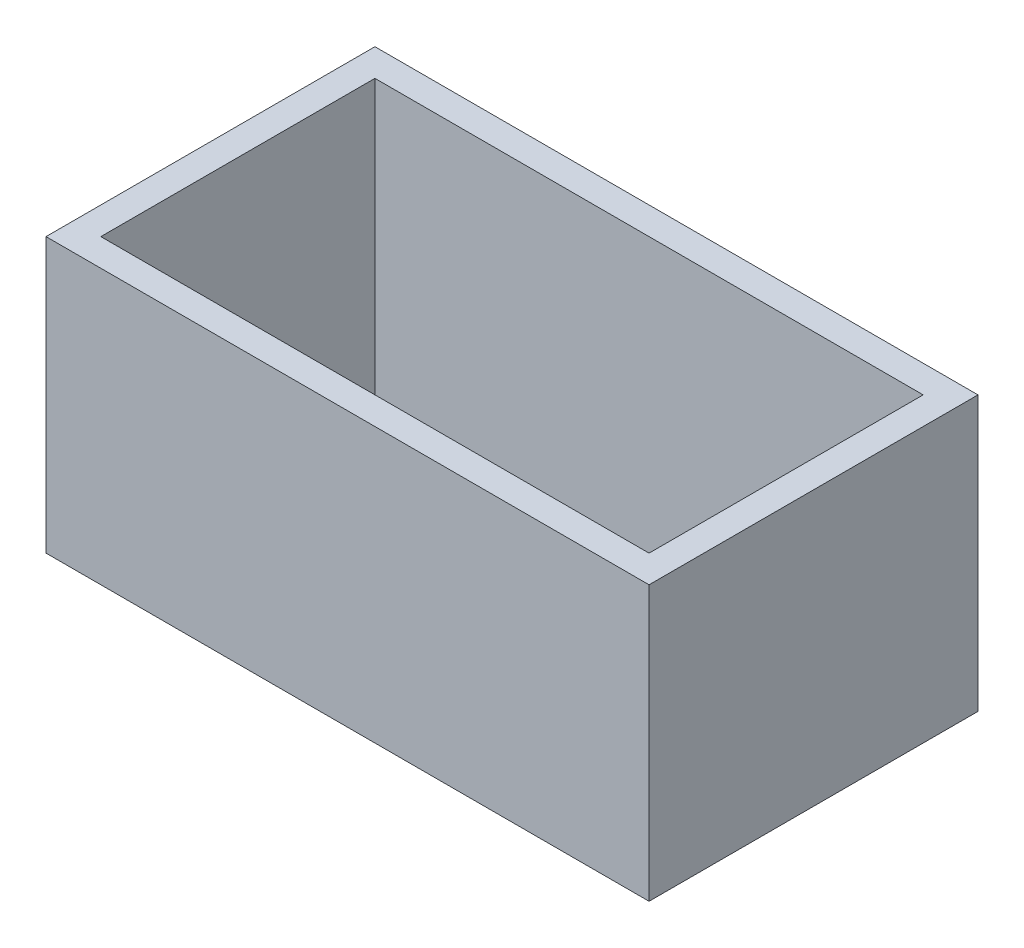
ISO-10303-21;
HEADER;
FILE_DESCRIPTION(('STEP AP214'),'2;1');
FILE_NAME('part.step','',(''),(''),'','','');
FILE_SCHEMA(('AUTOMOTIVE_DESIGN { 1 0 10303 214 1 1 1 1 }'));
ENDSEC;
DATA;
#1=APPLICATION_CONTEXT('core data for automotive mechanical design processes');
#2=APPLICATION_PROTOCOL_DEFINITION('international standard','automotive_design',2000,#1);
#3=PRODUCT_CONTEXT('',#1,'mechanical');
#4=PRODUCT('Part','Part','',(#3));
#5=PRODUCT_RELATED_PRODUCT_CATEGORY('part','',(#4));
#6=PRODUCT_DEFINITION_FORMATION('','',#4);
#7=PRODUCT_DEFINITION_CONTEXT('part definition',#1,'design');
#8=PRODUCT_DEFINITION('design','',#6,#7);
#9=PRODUCT_DEFINITION_SHAPE('','',#8);
#10=(LENGTH_UNIT() NAMED_UNIT(*) SI_UNIT(.MILLI.,.METRE.));
#11=(NAMED_UNIT(*) PLANE_ANGLE_UNIT() SI_UNIT($,.RADIAN.));
#12=(NAMED_UNIT(*) SI_UNIT($,.STERADIAN.) SOLID_ANGLE_UNIT());
#13=UNCERTAINTY_MEASURE_WITH_UNIT(LENGTH_MEASURE(1.E-05),#10,'distance_accuracy_value','');
#14=(GEOMETRIC_REPRESENTATION_CONTEXT(3) GLOBAL_UNCERTAINTY_ASSIGNED_CONTEXT((#13)) GLOBAL_UNIT_ASSIGNED_CONTEXT((#10,
#11,#12)) REPRESENTATION_CONTEXT('',''));
#15=CARTESIAN_POINT('',(0.,0.,0.));
#16=DIRECTION('',(0.,0.,1.));
#17=DIRECTION('',(1.,0.,0.));
#18=AXIS2_PLACEMENT_3D('',#15,#16,#17);
#19=CARTESIAN_POINT('',(0.,15.,0.));
#20=DIRECTION('',(0.,1.,0.));
#21=DIRECTION('',(0.,0.,1.));
#22=AXIS2_PLACEMENT_3D('',#19,#20,#21);
#23=PLANE('',#22);
#24=DIRECTION('',(0.,0.,-1.));
#25=VECTOR('',#24,1.);
#26=CARTESIAN_POINT('',(16.5,15.,9.));
#27=LINE('',#26,#25);
#28=CARTESIAN_POINT('',(16.5,15.,9.));
#29=VERTEX_POINT('',#28);
#30=CARTESIAN_POINT('',(16.5,15.,-9.));
#31=VERTEX_POINT('',#30);
#32=EDGE_CURVE('E134',#29,#31,#27,.T.);
#33=ORIENTED_EDGE('',*,*,#32,.T.);
#34=DIRECTION('',(-1.,0.,0.));
#35=VECTOR('',#34,1.);
#36=CARTESIAN_POINT('',(16.5,15.,-9.));
#37=LINE('',#36,#35);
#38=CARTESIAN_POINT('',(-16.5,15.,-9.));
#39=VERTEX_POINT('',#38);
#40=EDGE_CURVE('E137',#31,#39,#37,.T.);
#41=ORIENTED_EDGE('',*,*,#40,.T.);
#42=DIRECTION('',(0.,0.,1.));
#43=VECTOR('',#42,1.);
#44=CARTESIAN_POINT('',(-16.5,15.,9.));
#45=LINE('',#44,#43);
#46=CARTESIAN_POINT('',(-16.5,15.,9.));
#47=VERTEX_POINT('',#46);
#48=EDGE_CURVE('E140',#39,#47,#45,.T.);
#49=ORIENTED_EDGE('',*,*,#48,.T.);
#50=DIRECTION('',(1.,0.,0.));
#51=VECTOR('',#50,1.);
#52=CARTESIAN_POINT('',(16.5,15.,9.));
#53=LINE('',#52,#51);
#54=EDGE_CURVE('E142',#47,#29,#53,.T.);
#55=ORIENTED_EDGE('',*,*,#54,.T.);
#56=EDGE_LOOP('',(#33,#41,#49,#55));
#57=FACE_BOUND('',#56,.T.);
#58=DIRECTION('',(1.,0.,0.));
#59=VECTOR('',#58,1.);
#60=CARTESIAN_POINT('',(15.,15.,7.5));
#61=LINE('',#60,#59);
#62=CARTESIAN_POINT('',(-15.,15.,7.5));
#63=VERTEX_POINT('',#62);
#64=CARTESIAN_POINT('',(15.,15.,7.5));
#65=VERTEX_POINT('',#64);
#66=EDGE_CURVE('E106',#63,#65,#61,.T.);
#67=ORIENTED_EDGE('',*,*,#66,.F.);
#68=DIRECTION('',(0.,0.,1.));
#69=VECTOR('',#68,1.);
#70=CARTESIAN_POINT('',(-15.,15.,7.5));
#71=LINE('',#70,#69);
#72=CARTESIAN_POINT('',(-15.,15.,-7.5));
#73=VERTEX_POINT('',#72);
#74=EDGE_CURVE('E98',#73,#63,#71,.T.);
#75=ORIENTED_EDGE('',*,*,#74,.F.);
#76=DIRECTION('',(-1.,0.,0.));
#77=VECTOR('',#76,1.);
#78=CARTESIAN_POINT('',(15.,15.,-7.5));
#79=LINE('',#78,#77);
#80=CARTESIAN_POINT('',(15.,15.,-7.5));
#81=VERTEX_POINT('',#80);
#82=EDGE_CURVE('E120',#81,#73,#79,.T.);
#83=ORIENTED_EDGE('',*,*,#82,.F.);
#84=DIRECTION('',(0.,0.,-1.));
#85=VECTOR('',#84,1.);
#86=CARTESIAN_POINT('',(15.,15.,7.5));
#87=LINE('',#86,#85);
#88=EDGE_CURVE('E118',#65,#81,#87,.T.);
#89=ORIENTED_EDGE('',*,*,#88,.F.);
#90=EDGE_LOOP('',(#67,#75,#83,#89));
#91=FACE_BOUND('',#90,.T.);
#92=ADVANCED_FACE('F33',(#57,#91),#23,.T.);
#93=CARTESIAN_POINT('',(0.,0.,0.));
#94=DIRECTION('',(0.,1.,0.));
#95=DIRECTION('',(0.,0.,1.));
#96=AXIS2_PLACEMENT_3D('',#93,#94,#95);
#97=PLANE('',#96);
#98=DIRECTION('',(0.,0.,-1.));
#99=VECTOR('',#98,1.);
#100=CARTESIAN_POINT('',(16.5,0.,9.));
#101=LINE('',#100,#99);
#102=CARTESIAN_POINT('',(16.5,0.,9.));
#103=VERTEX_POINT('',#102);
#104=CARTESIAN_POINT('',(16.5,0.,-9.));
#105=VERTEX_POINT('',#104);
#106=EDGE_CURVE('E114',#103,#105,#101,.T.);
#107=ORIENTED_EDGE('',*,*,#106,.F.);
#108=DIRECTION('',(1.,0.,0.));
#109=VECTOR('',#108,1.);
#110=CARTESIAN_POINT('',(16.5,0.,9.));
#111=LINE('',#110,#109);
#112=CARTESIAN_POINT('',(-16.5,0.,9.));
#113=VERTEX_POINT('',#112);
#114=EDGE_CURVE('E138',#113,#103,#111,.T.);
#115=ORIENTED_EDGE('',*,*,#114,.F.);
#116=DIRECTION('',(0.,0.,1.));
#117=VECTOR('',#116,1.);
#118=CARTESIAN_POINT('',(-16.5,0.,9.));
#119=LINE('',#118,#117);
#120=CARTESIAN_POINT('',(-16.5,0.,-9.));
#121=VERTEX_POINT('',#120);
#122=EDGE_CURVE('E149',#121,#113,#119,.T.);
#123=ORIENTED_EDGE('',*,*,#122,.F.);
#124=DIRECTION('',(-1.,0.,0.));
#125=VECTOR('',#124,1.);
#126=CARTESIAN_POINT('',(16.5,0.,-9.));
#127=LINE('',#126,#125);
#128=EDGE_CURVE('E147',#105,#121,#127,.T.);
#129=ORIENTED_EDGE('',*,*,#128,.F.);
#130=EDGE_LOOP('',(#107,#115,#123,#129));
#131=FACE_BOUND('',#130,.T.);
#132=DIRECTION('',(0.,0.,1.));
#133=VECTOR('',#132,1.);
#134=CARTESIAN_POINT('',(-15.,0.,7.5));
#135=LINE('',#134,#133);
#136=CARTESIAN_POINT('',(-15.,0.,-7.5));
#137=VERTEX_POINT('',#136);
#138=CARTESIAN_POINT('',(-15.,0.,7.5));
#139=VERTEX_POINT('',#138);
#140=EDGE_CURVE('E56',#137,#139,#135,.T.);
#141=ORIENTED_EDGE('',*,*,#140,.T.);
#142=DIRECTION('',(1.,0.,0.));
#143=VECTOR('',#142,1.);
#144=CARTESIAN_POINT('',(15.,0.,7.5));
#145=LINE('',#144,#143);
#146=CARTESIAN_POINT('',(15.,0.,7.5));
#147=VERTEX_POINT('',#146);
#148=EDGE_CURVE('E113',#139,#147,#145,.T.);
#149=ORIENTED_EDGE('',*,*,#148,.T.);
#150=DIRECTION('',(0.,0.,-1.));
#151=VECTOR('',#150,1.);
#152=CARTESIAN_POINT('',(15.,0.,7.5));
#153=LINE('',#152,#151);
#154=CARTESIAN_POINT('',(15.,0.,-7.5));
#155=VERTEX_POINT('',#154);
#156=EDGE_CURVE('E126',#147,#155,#153,.T.);
#157=ORIENTED_EDGE('',*,*,#156,.T.);
#158=DIRECTION('',(-1.,0.,0.));
#159=VECTOR('',#158,1.);
#160=CARTESIAN_POINT('',(15.,0.,-7.5));
#161=LINE('',#160,#159);
#162=EDGE_CURVE('E107',#155,#137,#161,.T.);
#163=ORIENTED_EDGE('',*,*,#162,.T.);
#164=EDGE_LOOP('',(#141,#149,#157,#163));
#165=FACE_BOUND('',#164,.T.);
#166=ADVANCED_FACE('F167',(#131,#165),#97,.F.);
#167=CARTESIAN_POINT('',(16.5,15.,9.));
#168=DIRECTION('',(-1.,0.,0.));
#169=DIRECTION('',(0.,0.,1.));
#170=AXIS2_PLACEMENT_3D('',#167,#168,#169);
#171=PLANE('',#170);
#172=ORIENTED_EDGE('',*,*,#106,.T.);
#173=DIRECTION('',(0.,-1.,0.));
#174=VECTOR('',#173,1.);
#175=CARTESIAN_POINT('',(16.5,15.,-9.));
#176=LINE('',#175,#174);
#177=EDGE_CURVE('E11',#31,#105,#176,.T.);
#178=ORIENTED_EDGE('',*,*,#177,.F.);
#179=ORIENTED_EDGE('',*,*,#32,.F.);
#180=DIRECTION('',(0.,-1.,0.));
#181=VECTOR('',#180,1.);
#182=CARTESIAN_POINT('',(16.5,15.,9.));
#183=LINE('',#182,#181);
#184=EDGE_CURVE('E144',#29,#103,#183,.T.);
#185=ORIENTED_EDGE('',*,*,#184,.T.);
#186=EDGE_LOOP('',(#172,#178,#179,#185));
#187=FACE_BOUND('',#186,.T.);
#188=ADVANCED_FACE('F35',(#187),#171,.F.);
#189=CARTESIAN_POINT('',(16.5,15.,-9.));
#190=DIRECTION('',(0.,0.,1.));
#191=DIRECTION('',(1.,0.,0.));
#192=AXIS2_PLACEMENT_3D('',#189,#190,#191);
#193=PLANE('',#192);
#194=ORIENTED_EDGE('',*,*,#128,.T.);
#195=DIRECTION('',(0.,-1.,0.));
#196=VECTOR('',#195,1.);
#197=CARTESIAN_POINT('',(-16.5,15.,-9.));
#198=LINE('',#197,#196);
#199=EDGE_CURVE('E41',#39,#121,#198,.T.);
#200=ORIENTED_EDGE('',*,*,#199,.F.);
#201=ORIENTED_EDGE('',*,*,#40,.F.);
#202=ORIENTED_EDGE('',*,*,#177,.T.);
#203=EDGE_LOOP('',(#194,#200,#201,#202));
#204=FACE_BOUND('',#203,.T.);
#205=ADVANCED_FACE('F177',(#204),#193,.F.);
#206=CARTESIAN_POINT('',(-16.5,15.,9.));
#207=DIRECTION('',(1.,0.,0.));
#208=DIRECTION('',(0.,0.,-1.));
#209=AXIS2_PLACEMENT_3D('',#206,#207,#208);
#210=PLANE('',#209);
#211=ORIENTED_EDGE('',*,*,#122,.T.);
#212=DIRECTION('',(0.,-1.,0.));
#213=VECTOR('',#212,1.);
#214=CARTESIAN_POINT('',(-16.5,15.,9.));
#215=LINE('',#214,#213);
#216=EDGE_CURVE('E154',#47,#113,#215,.T.);
#217=ORIENTED_EDGE('',*,*,#216,.F.);
#218=ORIENTED_EDGE('',*,*,#48,.F.);
#219=ORIENTED_EDGE('',*,*,#199,.T.);
#220=EDGE_LOOP('',(#211,#217,#218,#219));
#221=FACE_BOUND('',#220,.T.);
#222=ADVANCED_FACE('F161',(#221),#210,.F.);
#223=CARTESIAN_POINT('',(16.5,15.,9.));
#224=DIRECTION('',(0.,0.,-1.));
#225=DIRECTION('',(-1.,0.,0.));
#226=AXIS2_PLACEMENT_3D('',#223,#224,#225);
#227=PLANE('',#226);
#228=ORIENTED_EDGE('',*,*,#114,.T.);
#229=ORIENTED_EDGE('',*,*,#184,.F.);
#230=ORIENTED_EDGE('',*,*,#54,.F.);
#231=ORIENTED_EDGE('',*,*,#216,.T.);
#232=EDGE_LOOP('',(#228,#229,#230,#231));
#233=FACE_BOUND('',#232,.T.);
#234=ADVANCED_FACE('F171',(#233),#227,.F.);
#235=CARTESIAN_POINT('',(-15.,15.,7.5));
#236=DIRECTION('',(1.,0.,0.));
#237=DIRECTION('',(0.,0.,-1.));
#238=AXIS2_PLACEMENT_3D('',#235,#236,#237);
#239=PLANE('',#238);
#240=ORIENTED_EDGE('',*,*,#140,.F.);
#241=DIRECTION('',(0.,-1.,0.));
#242=VECTOR('',#241,1.);
#243=CARTESIAN_POINT('',(-15.,15.,-7.5));
#244=LINE('',#243,#242);
#245=EDGE_CURVE('E102',#73,#137,#244,.T.);
#246=ORIENTED_EDGE('',*,*,#245,.F.);
#247=ORIENTED_EDGE('',*,*,#74,.T.);
#248=DIRECTION('',(0.,-1.,0.));
#249=VECTOR('',#248,1.);
#250=CARTESIAN_POINT('',(-15.,15.,7.5));
#251=LINE('',#250,#249);
#252=EDGE_CURVE('E101',#63,#139,#251,.T.);
#253=ORIENTED_EDGE('',*,*,#252,.T.);
#254=EDGE_LOOP('',(#240,#246,#247,#253));
#255=FACE_BOUND('',#254,.T.);
#256=ADVANCED_FACE('F100',(#255),#239,.T.);
#257=CARTESIAN_POINT('',(15.,15.,7.5));
#258=DIRECTION('',(0.,0.,-1.));
#259=DIRECTION('',(-1.,0.,0.));
#260=AXIS2_PLACEMENT_3D('',#257,#258,#259);
#261=PLANE('',#260);
#262=ORIENTED_EDGE('',*,*,#148,.F.);
#263=ORIENTED_EDGE('',*,*,#252,.F.);
#264=ORIENTED_EDGE('',*,*,#66,.T.);
#265=DIRECTION('',(0.,-1.,0.));
#266=VECTOR('',#265,1.);
#267=CARTESIAN_POINT('',(15.,15.,7.5));
#268=LINE('',#267,#266);
#269=EDGE_CURVE('E115',#65,#147,#268,.T.);
#270=ORIENTED_EDGE('',*,*,#269,.T.);
#271=EDGE_LOOP('',(#262,#263,#264,#270));
#272=FACE_BOUND('',#271,.T.);
#273=ADVANCED_FACE('F110',(#272),#261,.T.);
#274=CARTESIAN_POINT('',(15.,15.,7.5));
#275=DIRECTION('',(-1.,0.,0.));
#276=DIRECTION('',(0.,0.,1.));
#277=AXIS2_PLACEMENT_3D('',#274,#275,#276);
#278=PLANE('',#277);
#279=ORIENTED_EDGE('',*,*,#156,.F.);
#280=ORIENTED_EDGE('',*,*,#269,.F.);
#281=ORIENTED_EDGE('',*,*,#88,.T.);
#282=DIRECTION('',(0.,-1.,0.));
#283=VECTOR('',#282,1.);
#284=CARTESIAN_POINT('',(15.,15.,-7.5));
#285=LINE('',#284,#283);
#286=EDGE_CURVE('E48',#81,#155,#285,.T.);
#287=ORIENTED_EDGE('',*,*,#286,.T.);
#288=EDGE_LOOP('',(#279,#280,#281,#287));
#289=FACE_BOUND('',#288,.T.);
#290=ADVANCED_FACE('F200',(#289),#278,.T.);
#291=CARTESIAN_POINT('',(15.,15.,-7.5));
#292=DIRECTION('',(0.,0.,1.));
#293=DIRECTION('',(1.,0.,0.));
#294=AXIS2_PLACEMENT_3D('',#291,#292,#293);
#295=PLANE('',#294);
#296=ORIENTED_EDGE('',*,*,#162,.F.);
#297=ORIENTED_EDGE('',*,*,#286,.F.);
#298=ORIENTED_EDGE('',*,*,#82,.T.);
#299=ORIENTED_EDGE('',*,*,#245,.T.);
#300=EDGE_LOOP('',(#296,#297,#298,#299));
#301=FACE_BOUND('',#300,.T.);
#302=ADVANCED_FACE('F204',(#301),#295,.T.);
#303=CLOSED_SHELL('',(#92,#166,#188,#205,#222,#234,#256,#273,#290,#302));
#304=MANIFOLD_SOLID_BREP('B2',#303);
#305=ADVANCED_BREP_SHAPE_REPRESENTATION('',(#18,#304),#14);
#306=SHAPE_DEFINITION_REPRESENTATION(#9,#305);
ENDSEC;
END-ISO-10303-21;
